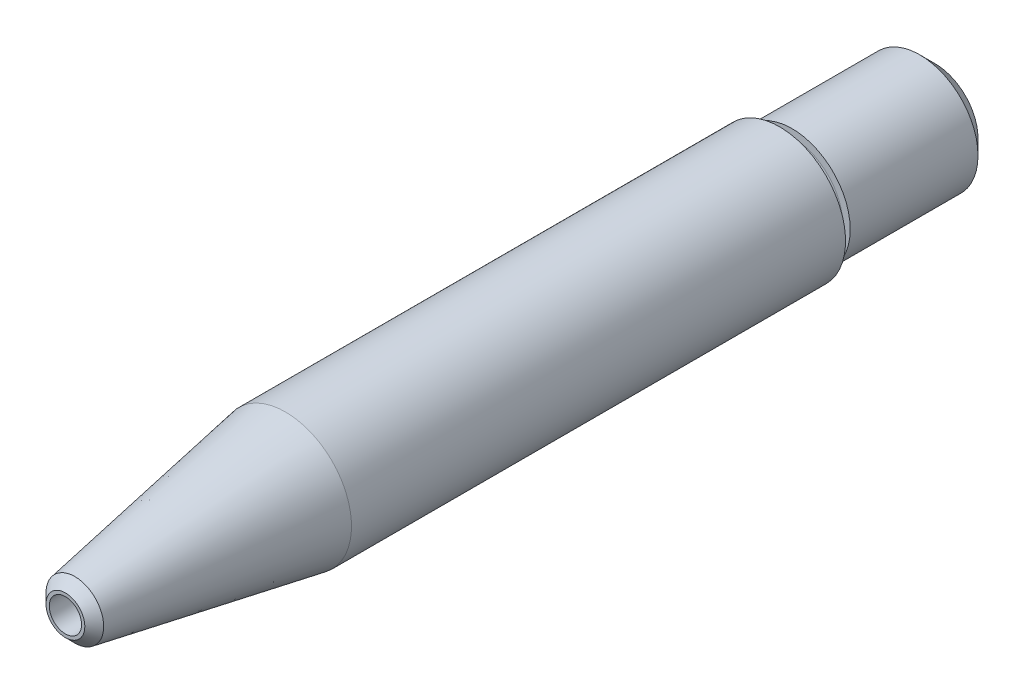
ISO-10303-21;
HEADER;
FILE_DESCRIPTION(('STEP AP214'),'2;1');
FILE_NAME('part.step','',(''),(''),'','','');
FILE_SCHEMA(('AUTOMOTIVE_DESIGN { 1 0 10303 214 1 1 1 1 }'));
ENDSEC;
DATA;
#1=APPLICATION_CONTEXT('core data for automotive mechanical design processes');
#2=APPLICATION_PROTOCOL_DEFINITION('international standard','automotive_design',2000,#1);
#3=PRODUCT_CONTEXT('',#1,'mechanical');
#4=PRODUCT('Part','Part','',(#3));
#5=PRODUCT_RELATED_PRODUCT_CATEGORY('part','',(#4));
#6=PRODUCT_DEFINITION_FORMATION('','',#4);
#7=PRODUCT_DEFINITION_CONTEXT('part definition',#1,'design');
#8=PRODUCT_DEFINITION('design','',#6,#7);
#9=PRODUCT_DEFINITION_SHAPE('','',#8);
#10=(LENGTH_UNIT() NAMED_UNIT(*) SI_UNIT(.MILLI.,.METRE.));
#11=(NAMED_UNIT(*) PLANE_ANGLE_UNIT() SI_UNIT($,.RADIAN.));
#12=(NAMED_UNIT(*) SI_UNIT($,.STERADIAN.) SOLID_ANGLE_UNIT());
#13=UNCERTAINTY_MEASURE_WITH_UNIT(LENGTH_MEASURE(1.E-05),#10,'distance_accuracy_value','');
#14=(GEOMETRIC_REPRESENTATION_CONTEXT(3) GLOBAL_UNCERTAINTY_ASSIGNED_CONTEXT((#13)) GLOBAL_UNIT_ASSIGNED_CONTEXT((#10,
#11,#12)) REPRESENTATION_CONTEXT('',''));
#15=CARTESIAN_POINT('',(0.,0.,0.));
#16=DIRECTION('',(0.,0.,1.));
#17=DIRECTION('',(1.,0.,0.));
#18=AXIS2_PLACEMENT_3D('',#15,#16,#17);
#19=CARTESIAN_POINT('',(0.,0.,0.));
#20=DIRECTION('',(0.,0.,1.));
#21=DIRECTION('',(1.,0.,0.));
#22=AXIS2_PLACEMENT_3D('',#19,#20,#21);
#23=PLANE('',#22);
#24=CARTESIAN_POINT('',(0.,0.,0.));
#25=DIRECTION('',(0.,0.,-1.));
#26=DIRECTION('',(-1.,0.,0.));
#27=AXIS2_PLACEMENT_3D('',#24,#25,#26);
#28=CIRCLE('',#27,3.17499999999999);
#29=CARTESIAN_POINT('',(-3.17499999999999,0.,0.));
#30=VERTEX_POINT('',#29);
#31=EDGE_CURVE('E65',#30,#30,#28,.T.);
#32=ORIENTED_EDGE('',*,*,#31,.F.);
#33=EDGE_LOOP('',(#32));
#34=FACE_BOUND('',#33,.T.);
#35=CARTESIAN_POINT('',(0.,0.,0.));
#36=DIRECTION('',(0.,0.,1.));
#37=DIRECTION('',(1.,0.,0.));
#38=AXIS2_PLACEMENT_3D('',#35,#36,#37);
#39=CIRCLE('',#38,3.5306);
#40=CARTESIAN_POINT('',(3.5306,0.,0.));
#41=VERTEX_POINT('',#40);
#42=EDGE_CURVE('E80',#41,#41,#39,.T.);
#43=ORIENTED_EDGE('',*,*,#42,.F.);
#44=EDGE_LOOP('',(#43));
#45=FACE_BOUND('',#44,.T.);
#46=ADVANCED_FACE('F36',(#34,#45),#23,.F.);
#47=CARTESIAN_POINT('',(0.,0.,71.12));
#48=DIRECTION('',(0.,0.,-1.));
#49=DIRECTION('',(-1.,0.,0.));
#50=AXIS2_PLACEMENT_3D('',#47,#48,#49);
#51=CYLINDRICAL_SURFACE('',#50,5.3975);
#52=CARTESIAN_POINT('',(0.,0.,53.1136802227138));
#53=DIRECTION('',(0.,0.,-1.));
#54=DIRECTION('',(-1.,0.,0.));
#55=AXIS2_PLACEMENT_3D('',#52,#53,#54);
#56=CIRCLE('',#55,5.3975);
#57=CARTESIAN_POINT('',(-5.3975,0.,53.1136802227138));
#58=VERTEX_POINT('',#57);
#59=EDGE_CURVE('E47',#58,#58,#56,.T.);
#60=ORIENTED_EDGE('',*,*,#59,.T.);
#61=EDGE_LOOP('',(#60));
#62=FACE_BOUND('',#61,.T.);
#63=CARTESIAN_POINT('',(0.,0.,12.7));
#64=DIRECTION('',(0.,0.,-1.));
#65=DIRECTION('',(-1.,0.,0.));
#66=AXIS2_PLACEMENT_3D('',#63,#64,#65);
#67=CIRCLE('',#66,5.3975);
#68=CARTESIAN_POINT('',(-5.3975,0.,12.7));
#69=VERTEX_POINT('',#68);
#70=EDGE_CURVE('E56',#69,#69,#67,.T.);
#71=ORIENTED_EDGE('',*,*,#70,.F.);
#72=EDGE_LOOP('',(#71));
#73=FACE_BOUND('',#72,.T.);
#74=ADVANCED_FACE('F87',(#62,#73),#51,.T.);
#75=CARTESIAN_POINT('',(0.,0.,53.1136802227138));
#76=DIRECTION('',(0.,0.,-1.));
#77=DIRECTION('',(-1.,0.,0.));
#78=AXIS2_PLACEMENT_3D('',#75,#76,#77);
#79=CONICAL_SURFACE('',#78,5.3975,0.174532925199434);
#80=CARTESIAN_POINT('',(0.,0.,70.3490630078594));
#81=DIRECTION('',(0.,0.,1.));
#82=DIRECTION('',(1.,0.,0.));
#83=AXIS2_PLACEMENT_3D('',#80,#81,#82);
#84=CIRCLE('',#83,2.35843699214061);
#85=CARTESIAN_POINT('',(2.35843699214061,0.,70.3490630078594));
#86=VERTEX_POINT('',#85);
#87=EDGE_CURVE('E43',#86,#86,#84,.F.);
#88=ORIENTED_EDGE('',*,*,#87,.T.);
#89=EDGE_LOOP('',(#88));
#90=FACE_BOUND('',#89,.T.);
#91=ORIENTED_EDGE('',*,*,#59,.F.);
#92=EDGE_LOOP('',(#91));
#93=FACE_BOUND('',#92,.T.);
#94=ADVANCED_FACE('F93',(#90,#93),#79,.T.);
#95=CARTESIAN_POINT('',(0.,0.,71.12));
#96=DIRECTION('',(0.,0.,1.));
#97=DIRECTION('',(1.,0.,0.));
#98=AXIS2_PLACEMENT_3D('',#95,#96,#97);
#99=PLANE('',#98);
#100=CARTESIAN_POINT('',(0.,0.,71.12));
#101=DIRECTION('',(0.,0.,1.));
#102=DIRECTION('',(1.,0.,0.));
#103=AXIS2_PLACEMENT_3D('',#100,#101,#102);
#104=CIRCLE('',#103,1.58750000000004);
#105=CARTESIAN_POINT('',(1.58750000000004,0.,71.12));
#106=VERTEX_POINT('',#105);
#107=EDGE_CURVE('E10',#106,#106,#104,.T.);
#108=ORIENTED_EDGE('',*,*,#107,.T.);
#109=EDGE_LOOP('',(#108));
#110=FACE_BOUND('',#109,.T.);
#111=CARTESIAN_POINT('',(0.,0.,71.12));
#112=DIRECTION('',(0.,0.,1.));
#113=DIRECTION('',(1.,0.,0.));
#114=AXIS2_PLACEMENT_3D('',#111,#112,#113);
#115=CIRCLE('',#114,1.3208);
#116=CARTESIAN_POINT('',(1.3208,0.,71.12));
#117=VERTEX_POINT('',#116);
#118=EDGE_CURVE('E51',#117,#117,#115,.T.);
#119=ORIENTED_EDGE('',*,*,#118,.F.);
#120=EDGE_LOOP('',(#119));
#121=FACE_BOUND('',#120,.T.);
#122=ADVANCED_FACE('F97',(#110,#121),#99,.T.);
#123=CARTESIAN_POINT('',(0.,0.,0.));
#124=DIRECTION('',(0.,0.,1.));
#125=DIRECTION('',(1.,0.,0.));
#126=AXIS2_PLACEMENT_3D('',#123,#124,#125);
#127=CYLINDRICAL_SURFACE('',#126,1.3208);
#128=CARTESIAN_POINT('',(0.,0.,62.0741157598009));
#129=DIRECTION('',(0.,0.,-1.));
#130=DIRECTION('',(-1.,0.,0.));
#131=AXIS2_PLACEMENT_3D('',#128,#129,#130);
#132=CIRCLE('',#131,1.3208);
#133=CARTESIAN_POINT('',(-1.3208,0.,62.0741157598009));
#134=VERTEX_POINT('',#133);
#135=EDGE_CURVE('E54',#134,#134,#132,.T.);
#136=ORIENTED_EDGE('',*,*,#135,.T.);
#137=EDGE_LOOP('',(#136));
#138=FACE_BOUND('',#137,.T.);
#139=ORIENTED_EDGE('',*,*,#118,.T.);
#140=EDGE_LOOP('',(#139));
#141=FACE_BOUND('',#140,.T.);
#142=ADVANCED_FACE('F100',(#138,#141),#127,.F.);
#143=CARTESIAN_POINT('',(0.,0.,12.7));
#144=DIRECTION('',(0.,0.,-1.));
#145=DIRECTION('',(-1.,0.,0.));
#146=AXIS2_PLACEMENT_3D('',#143,#144,#145);
#147=PLANE('',#146);
#148=ORIENTED_EDGE('',*,*,#70,.T.);
#149=EDGE_LOOP('',(#148));
#150=FACE_BOUND('',#149,.T.);
#151=CARTESIAN_POINT('',(0.,0.,12.7));
#152=DIRECTION('',(0.,0.,1.));
#153=DIRECTION('',(1.,0.,0.));
#154=AXIS2_PLACEMENT_3D('',#151,#152,#153);
#155=CIRCLE('',#154,4.1656);
#156=CARTESIAN_POINT('',(4.1656,0.,12.7));
#157=VERTEX_POINT('',#156);
#158=EDGE_CURVE('E68',#157,#157,#155,.T.);
#159=ORIENTED_EDGE('',*,*,#158,.T.);
#160=EDGE_LOOP('',(#159));
#161=FACE_BOUND('',#160,.T.);
#162=ADVANCED_FACE('F105',(#150,#161),#147,.T.);
#163=CARTESIAN_POINT('',(0.,0.,12.7));
#164=DIRECTION('',(0.,0.,-1.));
#165=DIRECTION('',(-1.,0.,0.));
#166=AXIS2_PLACEMENT_3D('',#163,#164,#165);
#167=CYLINDRICAL_SURFACE('',#166,4.7625);
#168=CARTESIAN_POINT('',(0.,0.,1.2319));
#169=DIRECTION('',(0.,0.,1.));
#170=DIRECTION('',(1.,0.,0.));
#171=AXIS2_PLACEMENT_3D('',#168,#169,#170);
#172=CIRCLE('',#171,4.7625);
#173=CARTESIAN_POINT('',(4.7625,0.,1.2319));
#174=VERTEX_POINT('',#173);
#175=EDGE_CURVE('E77',#174,#174,#172,.T.);
#176=ORIENTED_EDGE('',*,*,#175,.T.);
#177=EDGE_LOOP('',(#176));
#178=FACE_BOUND('',#177,.T.);
#179=CARTESIAN_POINT('',(0.,0.,11.684));
#180=DIRECTION('',(0.,0.,1.));
#181=DIRECTION('',(1.,0.,0.));
#182=AXIS2_PLACEMENT_3D('',#179,#180,#181);
#183=CIRCLE('',#182,4.7625);
#184=CARTESIAN_POINT('',(4.7625,0.,11.684));
#185=VERTEX_POINT('',#184);
#186=EDGE_CURVE('E74',#185,#185,#183,.T.);
#187=ORIENTED_EDGE('',*,*,#186,.F.);
#188=EDGE_LOOP('',(#187));
#189=FACE_BOUND('',#188,.T.);
#190=ADVANCED_FACE('F109',(#178,#189),#167,.T.);
#191=CARTESIAN_POINT('',(0.,0.,60.96));
#192=DIRECTION('',(0.,0.,-1.));
#193=DIRECTION('',(-1.,0.,0.));
#194=AXIS2_PLACEMENT_3D('',#191,#192,#193);
#195=CONICAL_SURFACE('',#194,3.17499999999998,1.02974425867665);
#196=CARTESIAN_POINT('',(0.,0.,60.96));
#197=DIRECTION('',(0.,0.,-1.));
#198=DIRECTION('',(-1.,0.,0.));
#199=AXIS2_PLACEMENT_3D('',#196,#197,#198);
#200=CIRCLE('',#199,3.17499999999998);
#201=CARTESIAN_POINT('',(-3.17499999999998,0.,60.96));
#202=VERTEX_POINT('',#201);
#203=EDGE_CURVE('E57',#202,#202,#200,.T.);
#204=ORIENTED_EDGE('',*,*,#203,.T.);
#205=EDGE_LOOP('',(#204));
#206=FACE_BOUND('',#205,.T.);
#207=ORIENTED_EDGE('',*,*,#135,.F.);
#208=EDGE_LOOP('',(#207));
#209=FACE_BOUND('',#208,.T.);
#210=ADVANCED_FACE('F113',(#206,#209),#195,.F.);
#211=CARTESIAN_POINT('',(0.,0.,0.));
#212=DIRECTION('',(0.,0.,-1.));
#213=DIRECTION('',(-1.,0.,0.));
#214=AXIS2_PLACEMENT_3D('',#211,#212,#213);
#215=CYLINDRICAL_SURFACE('',#214,3.17499999999999);
#216=ORIENTED_EDGE('',*,*,#203,.F.);
#217=EDGE_LOOP('',(#216));
#218=FACE_BOUND('',#217,.T.);
#219=ORIENTED_EDGE('',*,*,#31,.T.);
#220=EDGE_LOOP('',(#219));
#221=FACE_BOUND('',#220,.T.);
#222=ADVANCED_FACE('F117',(#218,#221),#215,.F.);
#223=CARTESIAN_POINT('',(0.,0.,12.192));
#224=DIRECTION('',(0.,0.,1.));
#225=DIRECTION('',(1.,0.,0.));
#226=AXIS2_PLACEMENT_3D('',#223,#224,#225);
#227=TOROIDAL_SURFACE('',#226,4.1656,0.508000000000002);
#228=ORIENTED_EDGE('',*,*,#158,.F.);
#229=EDGE_LOOP('',(#228));
#230=FACE_BOUND('',#229,.T.);
#231=CARTESIAN_POINT('',(0.,0.,11.684));
#232=DIRECTION('',(0.,0.,1.));
#233=DIRECTION('',(1.,0.,0.));
#234=AXIS2_PLACEMENT_3D('',#231,#232,#233);
#235=CIRCLE('',#234,4.1656);
#236=CARTESIAN_POINT('',(4.1656,0.,11.684));
#237=VERTEX_POINT('',#236);
#238=EDGE_CURVE('E71',#237,#237,#235,.T.);
#239=ORIENTED_EDGE('',*,*,#238,.T.);
#240=EDGE_LOOP('',(#239));
#241=FACE_BOUND('',#240,.T.);
#242=ADVANCED_FACE('F121',(#230,#241),#227,.F.);
#243=CARTESIAN_POINT('',(4.7625,0.,11.684));
#244=DIRECTION('',(0.,0.,-1.));
#245=DIRECTION('',(-1.,0.,0.));
#246=AXIS2_PLACEMENT_3D('',#243,#244,#245);
#247=PLANE('',#246);
#248=ORIENTED_EDGE('',*,*,#238,.F.);
#249=EDGE_LOOP('',(#248));
#250=FACE_BOUND('',#249,.T.);
#251=ORIENTED_EDGE('',*,*,#186,.T.);
#252=EDGE_LOOP('',(#251));
#253=FACE_BOUND('',#252,.T.);
#254=ADVANCED_FACE('F125',(#250,#253),#247,.F.);
#255=CARTESIAN_POINT('',(0.,0.,0.));
#256=DIRECTION('',(0.,0.,1.));
#257=DIRECTION('',(1.,0.,0.));
#258=AXIS2_PLACEMENT_3D('',#255,#256,#257);
#259=CONICAL_SURFACE('',#258,3.5306,0.785398163397448);
#260=ORIENTED_EDGE('',*,*,#175,.F.);
#261=EDGE_LOOP('',(#260));
#262=FACE_BOUND('',#261,.T.);
#263=ORIENTED_EDGE('',*,*,#42,.T.);
#264=EDGE_LOOP('',(#263));
#265=FACE_BOUND('',#264,.T.);
#266=ADVANCED_FACE('F84',(#262,#265),#259,.T.);
#267=CARTESIAN_POINT('',(0.,0.,70.3490630078594));
#268=DIRECTION('',(0.,0.,-1.));
#269=DIRECTION('',(-1.,0.,0.));
#270=AXIS2_PLACEMENT_3D('',#267,#268,#269);
#271=CONICAL_SURFACE('',#270,2.35843699214061,0.785398163397432);
#272=ORIENTED_EDGE('',*,*,#107,.F.);
#273=EDGE_LOOP('',(#272));
#274=FACE_BOUND('',#273,.T.);
#275=ORIENTED_EDGE('',*,*,#87,.F.);
#276=EDGE_LOOP('',(#275));
#277=FACE_BOUND('',#276,.T.);
#278=ADVANCED_FACE('F38',(#274,#277),#271,.T.);
#279=CLOSED_SHELL('',(#46,#74,#94,#122,#142,#162,#190,#210,#222,#242,#254,#266,#278));
#280=MANIFOLD_SOLID_BREP('B2',#279);
#281=ADVANCED_BREP_SHAPE_REPRESENTATION('',(#18,#280),#14);
#282=SHAPE_DEFINITION_REPRESENTATION(#9,#281);
ENDSEC;
END-ISO-10303-21;
